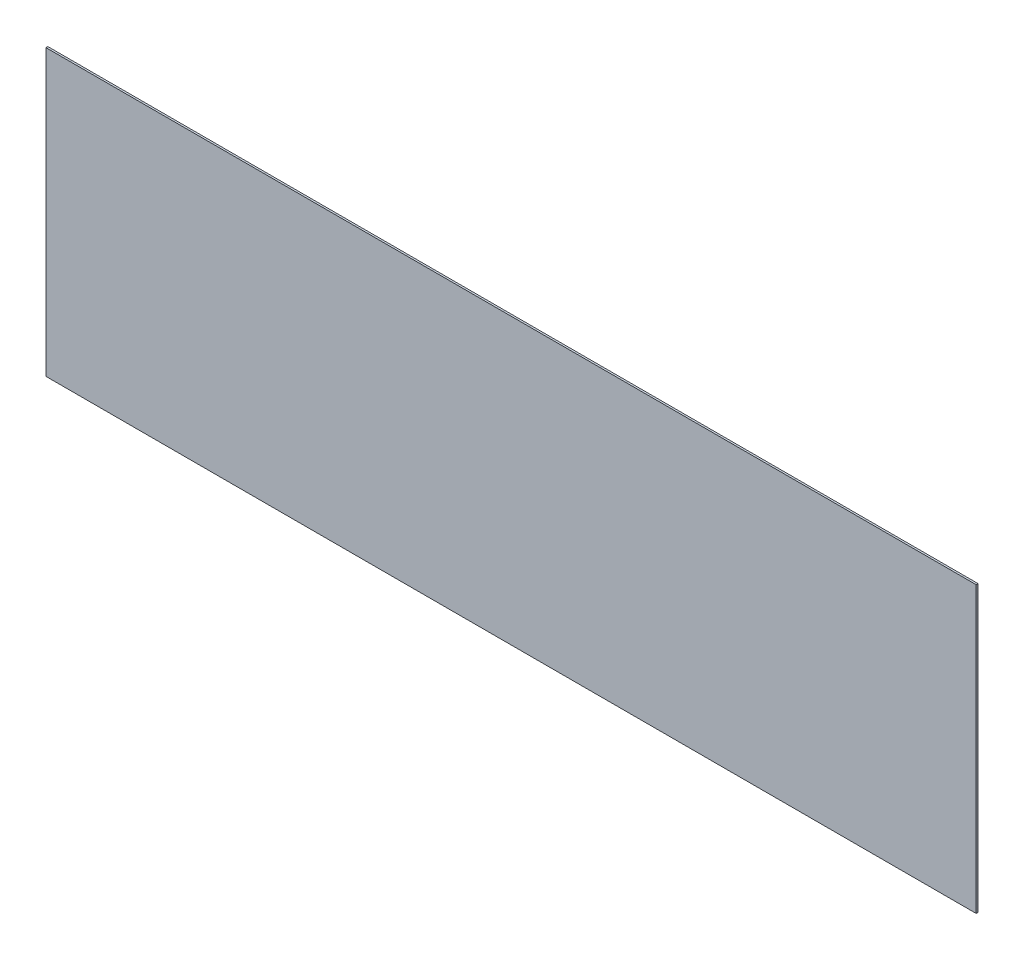
ISO-10303-21;
HEADER;
FILE_DESCRIPTION(('STEP AP214'),'2;1');
FILE_NAME('part.step','',(''),(''),'','','');
FILE_SCHEMA(('AUTOMOTIVE_DESIGN { 1 0 10303 214 1 1 1 1 }'));
ENDSEC;
DATA;
#1=APPLICATION_CONTEXT('core data for automotive mechanical design processes');
#2=APPLICATION_PROTOCOL_DEFINITION('international standard','automotive_design',2000,#1);
#3=PRODUCT_CONTEXT('',#1,'mechanical');
#4=PRODUCT('Part','Part','',(#3));
#5=PRODUCT_RELATED_PRODUCT_CATEGORY('part','',(#4));
#6=PRODUCT_DEFINITION_FORMATION('','',#4);
#7=PRODUCT_DEFINITION_CONTEXT('part definition',#1,'design');
#8=PRODUCT_DEFINITION('design','',#6,#7);
#9=PRODUCT_DEFINITION_SHAPE('','',#8);
#10=(LENGTH_UNIT() NAMED_UNIT(*) SI_UNIT(.MILLI.,.METRE.));
#11=(NAMED_UNIT(*) PLANE_ANGLE_UNIT() SI_UNIT($,.RADIAN.));
#12=(NAMED_UNIT(*) SI_UNIT($,.STERADIAN.) SOLID_ANGLE_UNIT());
#13=UNCERTAINTY_MEASURE_WITH_UNIT(LENGTH_MEASURE(1.E-05),#10,'distance_accuracy_value','');
#14=(GEOMETRIC_REPRESENTATION_CONTEXT(3) GLOBAL_UNCERTAINTY_ASSIGNED_CONTEXT((#13)) GLOBAL_UNIT_ASSIGNED_CONTEXT((#10,
#11,#12)) REPRESENTATION_CONTEXT('',''));
#15=CARTESIAN_POINT('',(0.,0.,0.));
#16=DIRECTION('',(0.,0.,1.));
#17=DIRECTION('',(1.,0.,0.));
#18=AXIS2_PLACEMENT_3D('',#15,#16,#17);
#19=CARTESIAN_POINT('',(-22.8797727395121,11.1962365591398,0.1));
#20=DIRECTION('',(1.,0.,0.));
#21=DIRECTION('',(0.,1.,0.));
#22=AXIS2_PLACEMENT_3D('',#19,#20,#21);
#23=PLANE('',#22);
#24=DIRECTION('',(0.,-1.,0.));
#25=VECTOR('',#24,1.);
#26=CARTESIAN_POINT('',(-22.8797727395121,11.1962365591398,0.));
#27=LINE('',#26,#25);
#28=CARTESIAN_POINT('',(-22.8797727395121,11.1962365591398,0.));
#29=VERTEX_POINT('',#28);
#30=CARTESIAN_POINT('',(-22.8797727395121,-3.80376344086022,0.));
#31=VERTEX_POINT('',#30);
#32=EDGE_CURVE('E96',#29,#31,#27,.T.);
#33=ORIENTED_EDGE('',*,*,#32,.T.);
#34=DIRECTION('',(0.,0.,-1.));
#35=VECTOR('',#34,1.);
#36=CARTESIAN_POINT('',(-22.8797727395121,-3.80376344086022,0.1));
#37=LINE('',#36,#35);
#38=CARTESIAN_POINT('',(-22.8797727395121,-3.80376344086022,0.1));
#39=VERTEX_POINT('',#38);
#40=EDGE_CURVE('E11',#39,#31,#37,.T.);
#41=ORIENTED_EDGE('',*,*,#40,.F.);
#42=DIRECTION('',(0.,-1.,0.));
#43=VECTOR('',#42,1.);
#44=CARTESIAN_POINT('',(-22.8797727395121,11.1962365591398,0.1));
#45=LINE('',#44,#43);
#46=CARTESIAN_POINT('',(-22.8797727395121,11.1962365591398,0.1));
#47=VERTEX_POINT('',#46);
#48=EDGE_CURVE('E84',#47,#39,#45,.T.);
#49=ORIENTED_EDGE('',*,*,#48,.F.);
#50=DIRECTION('',(0.,0.,-1.));
#51=VECTOR('',#50,1.);
#52=CARTESIAN_POINT('',(-22.8797727395121,11.1962365591398,0.1));
#53=LINE('',#52,#51);
#54=EDGE_CURVE('E92',#47,#29,#53,.T.);
#55=ORIENTED_EDGE('',*,*,#54,.T.);
#56=EDGE_LOOP('',(#33,#41,#49,#55));
#57=FACE_BOUND('',#56,.T.);
#58=ADVANCED_FACE('F33',(#57),#23,.F.);
#59=CARTESIAN_POINT('',(-22.8797727395121,-3.80376344086022,0.1));
#60=DIRECTION('',(0.,1.,0.));
#61=DIRECTION('',(0.,0.,1.));
#62=AXIS2_PLACEMENT_3D('',#59,#60,#61);
#63=PLANE('',#62);
#64=DIRECTION('',(1.,0.,0.));
#65=VECTOR('',#64,1.);
#66=CARTESIAN_POINT('',(-22.8797727395121,-3.80376344086022,0.));
#67=LINE('',#66,#65);
#68=CARTESIAN_POINT('',(26.1202272604879,-3.80376344086022,0.));
#69=VERTEX_POINT('',#68);
#70=EDGE_CURVE('E88',#31,#69,#67,.T.);
#71=ORIENTED_EDGE('',*,*,#70,.T.);
#72=DIRECTION('',(0.,0.,-1.));
#73=VECTOR('',#72,1.);
#74=CARTESIAN_POINT('',(26.1202272604879,-3.80376344086022,0.1));
#75=LINE('',#74,#73);
#76=CARTESIAN_POINT('',(26.1202272604879,-3.80376344086022,0.1));
#77=VERTEX_POINT('',#76);
#78=EDGE_CURVE('E41',#77,#69,#75,.T.);
#79=ORIENTED_EDGE('',*,*,#78,.F.);
#80=DIRECTION('',(1.,0.,0.));
#81=VECTOR('',#80,1.);
#82=CARTESIAN_POINT('',(-22.8797727395121,-3.80376344086022,0.1));
#83=LINE('',#82,#81);
#84=EDGE_CURVE('E79',#39,#77,#83,.T.);
#85=ORIENTED_EDGE('',*,*,#84,.F.);
#86=ORIENTED_EDGE('',*,*,#40,.T.);
#87=EDGE_LOOP('',(#71,#79,#85,#86));
#88=FACE_BOUND('',#87,.T.);
#89=ADVANCED_FACE('F87',(#88),#63,.F.);
#90=CARTESIAN_POINT('',(26.1202272604879,11.1962365591398,0.1));
#91=DIRECTION('',(-1.,0.,0.));
#92=DIRECTION('',(0.,-1.,0.));
#93=AXIS2_PLACEMENT_3D('',#90,#91,#92);
#94=PLANE('',#93);
#95=DIRECTION('',(0.,1.,0.));
#96=VECTOR('',#95,1.);
#97=CARTESIAN_POINT('',(26.1202272604879,11.1962365591398,0.));
#98=LINE('',#97,#96);
#99=CARTESIAN_POINT('',(26.1202272604879,11.1962365591398,0.));
#100=VERTEX_POINT('',#99);
#101=EDGE_CURVE('E66',#69,#100,#98,.T.);
#102=ORIENTED_EDGE('',*,*,#101,.T.);
#103=DIRECTION('',(0.,0.,-1.));
#104=VECTOR('',#103,1.);
#105=CARTESIAN_POINT('',(26.1202272604879,11.1962365591398,0.1));
#106=LINE('',#105,#104);
#107=CARTESIAN_POINT('',(26.1202272604879,11.1962365591398,0.1));
#108=VERTEX_POINT('',#107);
#109=EDGE_CURVE('E89',#108,#100,#106,.T.);
#110=ORIENTED_EDGE('',*,*,#109,.F.);
#111=DIRECTION('',(0.,1.,0.));
#112=VECTOR('',#111,1.);
#113=CARTESIAN_POINT('',(26.1202272604879,11.1962365591398,0.1));
#114=LINE('',#113,#112);
#115=EDGE_CURVE('E82',#77,#108,#114,.T.);
#116=ORIENTED_EDGE('',*,*,#115,.F.);
#117=ORIENTED_EDGE('',*,*,#78,.T.);
#118=EDGE_LOOP('',(#102,#110,#116,#117));
#119=FACE_BOUND('',#118,.T.);
#120=ADVANCED_FACE('F90',(#119),#94,.F.);
#121=CARTESIAN_POINT('',(-22.8797727395121,11.1962365591398,0.1));
#122=DIRECTION('',(0.,-1.,0.));
#123=DIRECTION('',(0.,0.,-1.));
#124=AXIS2_PLACEMENT_3D('',#121,#122,#123);
#125=PLANE('',#124);
#126=DIRECTION('',(-1.,0.,0.));
#127=VECTOR('',#126,1.);
#128=CARTESIAN_POINT('',(-22.8797727395121,11.1962365591398,0.));
#129=LINE('',#128,#127);
#130=EDGE_CURVE('E72',#100,#29,#129,.T.);
#131=ORIENTED_EDGE('',*,*,#130,.T.);
#132=ORIENTED_EDGE('',*,*,#54,.F.);
#133=DIRECTION('',(-1.,0.,0.));
#134=VECTOR('',#133,1.);
#135=CARTESIAN_POINT('',(-22.8797727395121,11.1962365591398,0.1));
#136=LINE('',#135,#134);
#137=EDGE_CURVE('E49',#108,#47,#136,.T.);
#138=ORIENTED_EDGE('',*,*,#137,.F.);
#139=ORIENTED_EDGE('',*,*,#109,.T.);
#140=EDGE_LOOP('',(#131,#132,#138,#139));
#141=FACE_BOUND('',#140,.T.);
#142=ADVANCED_FACE('F103',(#141),#125,.F.);
#143=CARTESIAN_POINT('',(0.,0.,0.1));
#144=DIRECTION('',(0.,0.,1.));
#145=DIRECTION('',(1.,0.,0.));
#146=AXIS2_PLACEMENT_3D('',#143,#144,#145);
#147=PLANE('',#146);
#148=ORIENTED_EDGE('',*,*,#48,.T.);
#149=ORIENTED_EDGE('',*,*,#84,.T.);
#150=ORIENTED_EDGE('',*,*,#115,.T.);
#151=ORIENTED_EDGE('',*,*,#137,.T.);
#152=EDGE_LOOP('',(#148,#149,#150,#151));
#153=FACE_BOUND('',#152,.T.);
#154=ADVANCED_FACE('F80',(#153),#147,.T.);
#155=CARTESIAN_POINT('',(0.,0.,0.));
#156=DIRECTION('',(0.,0.,1.));
#157=DIRECTION('',(1.,0.,0.));
#158=AXIS2_PLACEMENT_3D('',#155,#156,#157);
#159=PLANE('',#158);
#160=ORIENTED_EDGE('',*,*,#32,.F.);
#161=ORIENTED_EDGE('',*,*,#130,.F.);
#162=ORIENTED_EDGE('',*,*,#101,.F.);
#163=ORIENTED_EDGE('',*,*,#70,.F.);
#164=EDGE_LOOP('',(#160,#161,#162,#163));
#165=FACE_BOUND('',#164,.T.);
#166=ADVANCED_FACE('F106',(#165),#159,.F.);
#167=CLOSED_SHELL('',(#58,#89,#120,#142,#154,#166));
#168=MANIFOLD_SOLID_BREP('B2',#167);
#169=ADVANCED_BREP_SHAPE_REPRESENTATION('',(#18,#168),#14);
#170=SHAPE_DEFINITION_REPRESENTATION(#9,#169);
ENDSEC;
END-ISO-10303-21;
